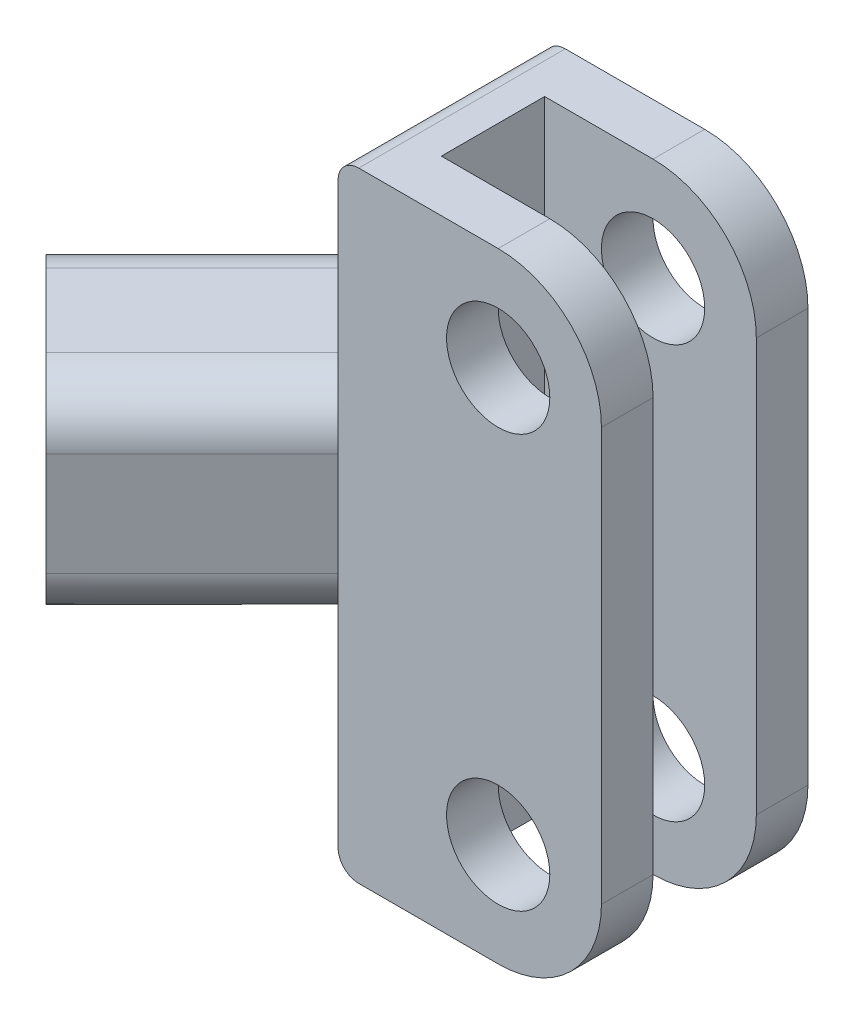
ISO-10303-21;
HEADER;
FILE_DESCRIPTION(('STEP AP214'),'2;1');
FILE_NAME('part.step','',(''),(''),'','','');
FILE_SCHEMA(('AUTOMOTIVE_DESIGN { 1 0 10303 214 1 1 1 1 }'));
ENDSEC;
DATA;
#1=APPLICATION_CONTEXT('core data for automotive mechanical design processes');
#2=APPLICATION_PROTOCOL_DEFINITION('international standard','automotive_design',2000,#1);
#3=PRODUCT_CONTEXT('',#1,'mechanical');
#4=PRODUCT('Part','Part','',(#3));
#5=PRODUCT_RELATED_PRODUCT_CATEGORY('part','',(#4));
#6=PRODUCT_DEFINITION_FORMATION('','',#4);
#7=PRODUCT_DEFINITION_CONTEXT('part definition',#1,'design');
#8=PRODUCT_DEFINITION('design','',#6,#7);
#9=PRODUCT_DEFINITION_SHAPE('','',#8);
#10=(LENGTH_UNIT() NAMED_UNIT(*) SI_UNIT(.MILLI.,.METRE.));
#11=(NAMED_UNIT(*) PLANE_ANGLE_UNIT() SI_UNIT($,.RADIAN.));
#12=(NAMED_UNIT(*) SI_UNIT($,.STERADIAN.) SOLID_ANGLE_UNIT());
#13=UNCERTAINTY_MEASURE_WITH_UNIT(LENGTH_MEASURE(1.E-05),#10,'distance_accuracy_value','');
#14=(GEOMETRIC_REPRESENTATION_CONTEXT(3) GLOBAL_UNCERTAINTY_ASSIGNED_CONTEXT((#13)) GLOBAL_UNIT_ASSIGNED_CONTEXT((#10,
#11,#12)) REPRESENTATION_CONTEXT('',''));
#15=CARTESIAN_POINT('',(0.,0.,0.));
#16=DIRECTION('',(0.,0.,1.));
#17=DIRECTION('',(1.,0.,0.));
#18=AXIS2_PLACEMENT_3D('',#15,#16,#17);
#19=CARTESIAN_POINT('',(-15.5,0.,5.));
#20=DIRECTION('',(1.,0.,0.));
#21=DIRECTION('',(0.,1.,0.));
#22=AXIS2_PLACEMENT_3D('',#19,#20,#21);
#23=PLANE('',#22);
#24=DIRECTION('',(0.,1.,0.));
#25=VECTOR('',#24,1.);
#26=CARTESIAN_POINT('',(-15.5,0.,10.));
#27=LINE('',#26,#25);
#28=CARTESIAN_POINT('',(-15.5,5.,10.));
#29=VERTEX_POINT('',#28);
#30=CARTESIAN_POINT('',(-15.5,28.,10.));
#31=VERTEX_POINT('',#30);
#32=EDGE_CURVE('E349',#29,#31,#27,.T.);
#33=ORIENTED_EDGE('',*,*,#32,.T.);
#34=DIRECTION('',(0.,0.,-1.));
#35=VECTOR('',#34,1.);
#36=CARTESIAN_POINT('',(-15.5,28.,5.));
#37=LINE('',#36,#35);
#38=CARTESIAN_POINT('',(-15.5,28.,-10.));
#39=VERTEX_POINT('',#38);
#40=EDGE_CURVE('E130',#31,#39,#37,.T.);
#41=ORIENTED_EDGE('',*,*,#40,.T.);
#42=DIRECTION('',(0.,-1.,0.));
#43=VECTOR('',#42,1.);
#44=CARTESIAN_POINT('',(-15.5,0.,-10.));
#45=LINE('',#44,#43);
#46=CARTESIAN_POINT('',(-15.5,5.,-10.));
#47=VERTEX_POINT('',#46);
#48=EDGE_CURVE('E289',#39,#47,#45,.T.);
#49=ORIENTED_EDGE('',*,*,#48,.T.);
#50=CARTESIAN_POINT('',(-15.5,5.,-5.));
#51=DIRECTION('',(1.,0.,0.));
#52=DIRECTION('',(0.,1.,0.));
#53=AXIS2_PLACEMENT_3D('',#50,#51,#52);
#54=CIRCLE('',#53,5.);
#55=CARTESIAN_POINT('',(-15.5,10.,-5.));
#56=VERTEX_POINT('',#55);
#57=EDGE_CURVE('E429',#47,#56,#54,.T.);
#58=ORIENTED_EDGE('',*,*,#57,.T.);
#59=DIRECTION('',(0.,0.,-1.));
#60=VECTOR('',#59,1.);
#61=CARTESIAN_POINT('',(-15.5,10.,10.));
#62=LINE('',#61,#60);
#63=CARTESIAN_POINT('',(-15.5,10.,2.92893218813449));
#64=VERTEX_POINT('',#63);
#65=EDGE_CURVE('E492',#64,#56,#62,.T.);
#66=ORIENTED_EDGE('',*,*,#65,.F.);
#67=CARTESIAN_POINT('',(-15.5,5.,2.92893218813448));
#68=DIRECTION('',(1.,0.,0.));
#69=DIRECTION('',(0.,0.,1.));
#70=AXIS2_PLACEMENT_3D('',#67,#68,#69);
#71=ELLIPSE('',#70,7.07106781186552,5.);
#72=EDGE_CURVE('E433',#64,#29,#71,.T.);
#73=ORIENTED_EDGE('',*,*,#72,.T.);
#74=EDGE_LOOP('',(#33,#41,#49,#58,#66,#73));
#75=FACE_BOUND('',#74,.T.);
#76=ADVANCED_FACE('F122',(#75),#23,.F.);
#77=CARTESIAN_POINT('',(-15.5,-5.,-10.));
#78=VERTEX_POINT('',#77);
#79=CARTESIAN_POINT('',(-15.5,-28.,-10.));
#80=VERTEX_POINT('',#79);
#81=EDGE_CURVE('E460',#78,#80,#45,.T.);
#82=ORIENTED_EDGE('',*,*,#81,.T.);
#83=DIRECTION('',(0.,0.,-1.));
#84=VECTOR('',#83,1.);
#85=CARTESIAN_POINT('',(-15.5,-28.,5.));
#86=LINE('',#85,#84);
#87=CARTESIAN_POINT('',(-15.5,-28.,10.));
#88=VERTEX_POINT('',#87);
#89=EDGE_CURVE('E448',#80,#88,#86,.F.);
#90=ORIENTED_EDGE('',*,*,#89,.T.);
#91=CARTESIAN_POINT('',(-15.5,-5.,10.));
#92=VERTEX_POINT('',#91);
#93=EDGE_CURVE('E350',#88,#92,#27,.T.);
#94=ORIENTED_EDGE('',*,*,#93,.T.);
#95=CARTESIAN_POINT('',(-15.5,-5.,2.92893218813447));
#96=DIRECTION('',(1.,0.,0.));
#97=DIRECTION('',(0.,0.,-1.));
#98=AXIS2_PLACEMENT_3D('',#95,#96,#97);
#99=ELLIPSE('',#98,7.07106781186552,5.);
#100=CARTESIAN_POINT('',(-15.5,-10.,2.92893218813448));
#101=VERTEX_POINT('',#100);
#102=EDGE_CURVE('E431',#92,#101,#99,.T.);
#103=ORIENTED_EDGE('',*,*,#102,.T.);
#104=DIRECTION('',(0.,0.,-1.));
#105=VECTOR('',#104,1.);
#106=CARTESIAN_POINT('',(-15.5,-10.,10.));
#107=LINE('',#106,#105);
#108=CARTESIAN_POINT('',(-15.5,-10.,-5.));
#109=VERTEX_POINT('',#108);
#110=EDGE_CURVE('E439',#101,#109,#107,.T.);
#111=ORIENTED_EDGE('',*,*,#110,.T.);
#112=CARTESIAN_POINT('',(-15.5,-5.,-5.));
#113=DIRECTION('',(1.,0.,0.));
#114=DIRECTION('',(0.,1.,0.));
#115=AXIS2_PLACEMENT_3D('',#112,#113,#114);
#116=CIRCLE('',#115,5.);
#117=EDGE_CURVE('E426',#109,#78,#116,.T.);
#118=ORIENTED_EDGE('',*,*,#117,.T.);
#119=EDGE_LOOP('',(#82,#90,#94,#103,#111,#118));
#120=FACE_BOUND('',#119,.T.);
#121=ADVANCED_FACE('F590',(#120),#23,.F.);
#122=CARTESIAN_POINT('',(0.,-30.,5.));
#123=DIRECTION('',(0.,1.,0.));
#124=DIRECTION('',(0.,0.,1.));
#125=AXIS2_PLACEMENT_3D('',#122,#123,#124);
#126=PLANE('',#125);
#127=DIRECTION('',(-1.,0.,0.));
#128=VECTOR('',#127,1.);
#129=CARTESIAN_POINT('',(0.,-30.,10.));
#130=LINE('',#129,#128);
#131=CARTESIAN_POINT('',(0.,-30.,10.));
#132=VERTEX_POINT('',#131);
#133=CARTESIAN_POINT('',(-13.5,-30.,10.));
#134=VERTEX_POINT('',#133);
#135=EDGE_CURVE('E352',#132,#134,#130,.T.);
#136=ORIENTED_EDGE('',*,*,#135,.T.);
#137=DIRECTION('',(0.,0.,-1.));
#138=VECTOR('',#137,1.);
#139=CARTESIAN_POINT('',(-13.5,-30.,5.));
#140=LINE('',#139,#138);
#141=CARTESIAN_POINT('',(-13.5,-30.,-10.));
#142=VERTEX_POINT('',#141);
#143=EDGE_CURVE('E436',#134,#142,#140,.T.);
#144=ORIENTED_EDGE('',*,*,#143,.T.);
#145=DIRECTION('',(-1.,0.,0.));
#146=VECTOR('',#145,1.);
#147=CARTESIAN_POINT('',(0.,-30.,-10.));
#148=LINE('',#147,#146);
#149=CARTESIAN_POINT('',(0.,-30.,-10.));
#150=VERTEX_POINT('',#149);
#151=EDGE_CURVE('E326',#150,#142,#148,.T.);
#152=ORIENTED_EDGE('',*,*,#151,.F.);
#153=DIRECTION('',(0.,0.,1.));
#154=VECTOR('',#153,1.);
#155=CARTESIAN_POINT('',(0.,-30.,-10.));
#156=LINE('',#155,#154);
#157=CARTESIAN_POINT('',(0.,-30.,-5.));
#158=VERTEX_POINT('',#157);
#159=EDGE_CURVE('E312',#150,#158,#156,.T.);
#160=ORIENTED_EDGE('',*,*,#159,.T.);
#161=DIRECTION('',(-1.,0.,0.));
#162=VECTOR('',#161,1.);
#163=CARTESIAN_POINT('',(0.,-30.,-5.));
#164=LINE('',#163,#162);
#165=CARTESIAN_POINT('',(-10.5,-30.,-5.));
#166=VERTEX_POINT('',#165);
#167=EDGE_CURVE('E313',#158,#166,#164,.T.);
#168=ORIENTED_EDGE('',*,*,#167,.T.);
#169=DIRECTION('',(0.,0.,-1.));
#170=VECTOR('',#169,1.);
#171=CARTESIAN_POINT('',(-10.5,-30.,5.));
#172=LINE('',#171,#170);
#173=CARTESIAN_POINT('',(-10.5,-30.,5.));
#174=VERTEX_POINT('',#173);
#175=EDGE_CURVE('E387',#174,#166,#172,.T.);
#176=ORIENTED_EDGE('',*,*,#175,.F.);
#177=DIRECTION('',(-1.,0.,0.));
#178=VECTOR('',#177,1.);
#179=CARTESIAN_POINT('',(0.,-30.,5.));
#180=LINE('',#179,#178);
#181=CARTESIAN_POINT('',(0.,-30.,5.));
#182=VERTEX_POINT('',#181);
#183=EDGE_CURVE('E364',#182,#174,#180,.T.);
#184=ORIENTED_EDGE('',*,*,#183,.F.);
#185=DIRECTION('',(0.,0.,-1.));
#186=VECTOR('',#185,1.);
#187=CARTESIAN_POINT('',(0.,-30.,10.));
#188=LINE('',#187,#186);
#189=EDGE_CURVE('E374',#132,#182,#188,.T.);
#190=ORIENTED_EDGE('',*,*,#189,.F.);
#191=EDGE_LOOP('',(#136,#144,#152,#160,#168,#176,#184,#190));
#192=FACE_BOUND('',#191,.T.);
#193=ADVANCED_FACE('F545',(#192),#126,.F.);
#194=CARTESIAN_POINT('',(-10.5,0.,5.));
#195=DIRECTION('',(1.,0.,0.));
#196=DIRECTION('',(0.,1.,0.));
#197=AXIS2_PLACEMENT_3D('',#194,#195,#196);
#198=PLANE('',#197);
#199=DIRECTION('',(0.,-1.,0.));
#200=VECTOR('',#199,1.);
#201=CARTESIAN_POINT('',(-10.5,0.,-5.));
#202=LINE('',#201,#200);
#203=CARTESIAN_POINT('',(-10.5,30.,-5.));
#204=VERTEX_POINT('',#203);
#205=EDGE_CURVE('E379',#204,#166,#202,.T.);
#206=ORIENTED_EDGE('',*,*,#205,.F.);
#207=DIRECTION('',(0.,0.,-1.));
#208=VECTOR('',#207,1.);
#209=CARTESIAN_POINT('',(-10.5,30.,5.));
#210=LINE('',#209,#208);
#211=CARTESIAN_POINT('',(-10.5,30.,5.));
#212=VERTEX_POINT('',#211);
#213=EDGE_CURVE('E383',#212,#204,#210,.T.);
#214=ORIENTED_EDGE('',*,*,#213,.F.);
#215=DIRECTION('',(0.,-1.,0.));
#216=VECTOR('',#215,1.);
#217=CARTESIAN_POINT('',(-10.5,0.,5.));
#218=LINE('',#217,#216);
#219=EDGE_CURVE('E380',#212,#174,#218,.T.);
#220=ORIENTED_EDGE('',*,*,#219,.T.);
#221=ORIENTED_EDGE('',*,*,#175,.T.);
#222=EDGE_LOOP('',(#206,#214,#220,#221));
#223=FACE_BOUND('',#222,.T.);
#224=ADVANCED_FACE('F559',(#223),#198,.T.);
#225=CARTESIAN_POINT('',(0.,30.,5.));
#226=DIRECTION('',(0.,-1.,0.));
#227=DIRECTION('',(0.,0.,-1.));
#228=AXIS2_PLACEMENT_3D('',#225,#226,#227);
#229=PLANE('',#228);
#230=DIRECTION('',(1.,0.,0.));
#231=VECTOR('',#230,1.);
#232=CARTESIAN_POINT('',(0.,30.,-10.));
#233=LINE('',#232,#231);
#234=CARTESIAN_POINT('',(-13.5,30.,-10.));
#235=VERTEX_POINT('',#234);
#236=CARTESIAN_POINT('',(0.,30.,-10.));
#237=VERTEX_POINT('',#236);
#238=EDGE_CURVE('E281',#235,#237,#233,.T.);
#239=ORIENTED_EDGE('',*,*,#238,.F.);
#240=DIRECTION('',(0.,0.,-1.));
#241=VECTOR('',#240,1.);
#242=CARTESIAN_POINT('',(-13.5,30.,5.));
#243=LINE('',#242,#241);
#244=CARTESIAN_POINT('',(-13.5,30.,10.));
#245=VERTEX_POINT('',#244);
#246=EDGE_CURVE('E12',#235,#245,#243,.F.);
#247=ORIENTED_EDGE('',*,*,#246,.T.);
#248=DIRECTION('',(1.,0.,0.));
#249=VECTOR('',#248,1.);
#250=CARTESIAN_POINT('',(0.,30.,10.));
#251=LINE('',#250,#249);
#252=CARTESIAN_POINT('',(0.,30.,10.));
#253=VERTEX_POINT('',#252);
#254=EDGE_CURVE('E346',#245,#253,#251,.T.);
#255=ORIENTED_EDGE('',*,*,#254,.T.);
#256=DIRECTION('',(0.,0.,-1.));
#257=VECTOR('',#256,1.);
#258=CARTESIAN_POINT('',(0.,30.,10.));
#259=LINE('',#258,#257);
#260=CARTESIAN_POINT('',(0.,30.,5.));
#261=VERTEX_POINT('',#260);
#262=EDGE_CURVE('E376',#253,#261,#259,.T.);
#263=ORIENTED_EDGE('',*,*,#262,.T.);
#264=DIRECTION('',(1.,0.,0.));
#265=VECTOR('',#264,1.);
#266=CARTESIAN_POINT('',(0.,30.,5.));
#267=LINE('',#266,#265);
#268=EDGE_CURVE('E362',#212,#261,#267,.T.);
#269=ORIENTED_EDGE('',*,*,#268,.F.);
#270=ORIENTED_EDGE('',*,*,#213,.T.);
#271=DIRECTION('',(1.,0.,0.));
#272=VECTOR('',#271,1.);
#273=CARTESIAN_POINT('',(0.,30.,-5.));
#274=LINE('',#273,#272);
#275=CARTESIAN_POINT('',(0.,30.,-5.));
#276=VERTEX_POINT('',#275);
#277=EDGE_CURVE('E295',#204,#276,#274,.T.);
#278=ORIENTED_EDGE('',*,*,#277,.T.);
#279=DIRECTION('',(0.,0.,1.));
#280=VECTOR('',#279,1.);
#281=CARTESIAN_POINT('',(0.,30.,-10.));
#282=LINE('',#281,#280);
#283=EDGE_CURVE('E292',#237,#276,#282,.T.);
#284=ORIENTED_EDGE('',*,*,#283,.F.);
#285=EDGE_LOOP('',(#239,#247,#255,#263,#269,#270,#278,#284));
#286=FACE_BOUND('',#285,.T.);
#287=ADVANCED_FACE('F293',(#286),#229,.F.);
#288=CARTESIAN_POINT('',(0.,20.,10.));
#289=DIRECTION('',(0.,0.,1.));
#290=DIRECTION('',(1.,0.,0.));
#291=AXIS2_PLACEMENT_3D('',#288,#289,#290);
#292=PLANE('',#291);
#293=CARTESIAN_POINT('',(0.,-20.,10.));
#294=DIRECTION('',(0.,0.,1.));
#295=DIRECTION('',(1.,0.,0.));
#296=AXIS2_PLACEMENT_3D('',#293,#294,#295);
#297=CIRCLE('',#296,5.);
#298=CARTESIAN_POINT('',(5.,-20.,10.));
#299=VERTEX_POINT('',#298);
#300=EDGE_CURVE('E337',#299,#299,#297,.T.);
#301=ORIENTED_EDGE('',*,*,#300,.F.);
#302=EDGE_LOOP('',(#301));
#303=FACE_BOUND('',#302,.T.);
#304=ORIENTED_EDGE('',*,*,#93,.F.);
#305=CARTESIAN_POINT('',(-13.5,-28.,10.));
#306=DIRECTION('',(0.,0.,1.));
#307=DIRECTION('',(1.,0.,0.));
#308=AXIS2_PLACEMENT_3D('',#305,#306,#307);
#309=CIRCLE('',#308,2.);
#310=EDGE_CURVE('E451',#88,#134,#309,.T.);
#311=ORIENTED_EDGE('',*,*,#310,.T.);
#312=ORIENTED_EDGE('',*,*,#135,.F.);
#313=CARTESIAN_POINT('',(0.,-20.,10.));
#314=DIRECTION('',(0.,0.,1.));
#315=DIRECTION('',(1.,0.,0.));
#316=AXIS2_PLACEMENT_3D('',#313,#314,#315);
#317=CIRCLE('',#316,9.99999999999999);
#318=CARTESIAN_POINT('',(10.,-20.,10.));
#319=VERTEX_POINT('',#318);
#320=EDGE_CURVE('E355',#132,#319,#317,.T.);
#321=ORIENTED_EDGE('',*,*,#320,.T.);
#322=DIRECTION('',(0.,1.,0.));
#323=VECTOR('',#322,1.);
#324=CARTESIAN_POINT('',(9.99999999999999,0.,10.));
#325=LINE('',#324,#323);
#326=CARTESIAN_POINT('',(9.99999999999998,20.,10.));
#327=VERTEX_POINT('',#326);
#328=EDGE_CURVE('E357',#319,#327,#325,.T.);
#329=ORIENTED_EDGE('',*,*,#328,.T.);
#330=CARTESIAN_POINT('',(0.,20.,10.));
#331=DIRECTION('',(0.,0.,1.));
#332=DIRECTION('',(1.,0.,0.));
#333=AXIS2_PLACEMENT_3D('',#330,#331,#332);
#334=CIRCLE('',#333,9.99999999999999);
#335=EDGE_CURVE('E343',#327,#253,#334,.T.);
#336=ORIENTED_EDGE('',*,*,#335,.T.);
#337=ORIENTED_EDGE('',*,*,#254,.F.);
#338=CARTESIAN_POINT('',(-13.5,28.,10.));
#339=DIRECTION('',(0.,0.,1.));
#340=DIRECTION('',(1.,0.,0.));
#341=AXIS2_PLACEMENT_3D('',#338,#339,#340);
#342=CIRCLE('',#341,2.);
#343=EDGE_CURVE('E137',#245,#31,#342,.T.);
#344=ORIENTED_EDGE('',*,*,#343,.T.);
#345=ORIENTED_EDGE('',*,*,#32,.F.);
#346=DIRECTION('',(0.,-1.,0.));
#347=VECTOR('',#346,1.);
#348=CARTESIAN_POINT('',(-15.5,10.,10.));
#349=LINE('',#348,#347);
#350=EDGE_CURVE('E473',#29,#92,#349,.T.);
#351=ORIENTED_EDGE('',*,*,#350,.T.);
#352=EDGE_LOOP('',(#304,#311,#312,#321,#329,#336,#337,#344,#345,#351));
#353=FACE_BOUND('',#352,.T.);
#354=CARTESIAN_POINT('',(0.,20.,10.));
#355=DIRECTION('',(0.,0.,1.));
#356=DIRECTION('',(1.,0.,0.));
#357=AXIS2_PLACEMENT_3D('',#354,#355,#356);
#358=CIRCLE('',#357,5.);
#359=CARTESIAN_POINT('',(4.99999999999999,20.,10.));
#360=VERTEX_POINT('',#359);
#361=EDGE_CURVE('E331',#360,#360,#358,.T.);
#362=ORIENTED_EDGE('',*,*,#361,.F.);
#363=EDGE_LOOP('',(#362));
#364=FACE_BOUND('',#363,.T.);
#365=ADVANCED_FACE('F534',(#303,#353,#364),#292,.T.);
#366=CARTESIAN_POINT('',(0.,20.,5.));
#367=DIRECTION('',(0.,0.,1.));
#368=DIRECTION('',(1.,0.,0.));
#369=AXIS2_PLACEMENT_3D('',#366,#367,#368);
#370=PLANE('',#369);
#371=ORIENTED_EDGE('',*,*,#219,.F.);
#372=ORIENTED_EDGE('',*,*,#268,.T.);
#373=CARTESIAN_POINT('',(0.,20.,5.));
#374=DIRECTION('',(0.,0.,1.));
#375=DIRECTION('',(1.,0.,0.));
#376=AXIS2_PLACEMENT_3D('',#373,#374,#375);
#377=CIRCLE('',#376,9.99999999999999);
#378=CARTESIAN_POINT('',(9.99999999999998,20.,5.));
#379=VERTEX_POINT('',#378);
#380=EDGE_CURVE('E340',#379,#261,#377,.T.);
#381=ORIENTED_EDGE('',*,*,#380,.F.);
#382=DIRECTION('',(0.,1.,0.));
#383=VECTOR('',#382,1.);
#384=CARTESIAN_POINT('',(9.99999999999999,0.,5.));
#385=LINE('',#384,#383);
#386=CARTESIAN_POINT('',(10.,-20.,5.));
#387=VERTEX_POINT('',#386);
#388=EDGE_CURVE('E347',#387,#379,#385,.T.);
#389=ORIENTED_EDGE('',*,*,#388,.F.);
#390=CARTESIAN_POINT('',(0.,-20.,5.));
#391=DIRECTION('',(0.,0.,1.));
#392=DIRECTION('',(1.,0.,0.));
#393=AXIS2_PLACEMENT_3D('',#390,#391,#392);
#394=CIRCLE('',#393,9.99999999999999);
#395=EDGE_CURVE('E366',#182,#387,#394,.T.);
#396=ORIENTED_EDGE('',*,*,#395,.F.);
#397=ORIENTED_EDGE('',*,*,#183,.T.);
#398=EDGE_LOOP('',(#371,#372,#381,#389,#396,#397));
#399=FACE_BOUND('',#398,.T.);
#400=CARTESIAN_POINT('',(0.,-20.,5.));
#401=DIRECTION('',(0.,0.,1.));
#402=DIRECTION('',(1.,0.,0.));
#403=AXIS2_PLACEMENT_3D('',#400,#401,#402);
#404=CIRCLE('',#403,5.);
#405=CARTESIAN_POINT('',(5.,-20.,5.));
#406=VERTEX_POINT('',#405);
#407=EDGE_CURVE('E334',#406,#406,#404,.T.);
#408=ORIENTED_EDGE('',*,*,#407,.T.);
#409=EDGE_LOOP('',(#408));
#410=FACE_BOUND('',#409,.T.);
#411=CARTESIAN_POINT('',(0.,20.,5.));
#412=DIRECTION('',(0.,0.,1.));
#413=DIRECTION('',(1.,0.,0.));
#414=AXIS2_PLACEMENT_3D('',#411,#412,#413);
#415=CIRCLE('',#414,5.);
#416=CARTESIAN_POINT('',(4.99999999999999,20.,5.));
#417=VERTEX_POINT('',#416);
#418=EDGE_CURVE('E299',#417,#417,#415,.T.);
#419=ORIENTED_EDGE('',*,*,#418,.T.);
#420=EDGE_LOOP('',(#419));
#421=FACE_BOUND('',#420,.T.);
#422=ADVANCED_FACE('F564',(#399,#410,#421),#370,.F.);
#423=CARTESIAN_POINT('',(0.,20.,10.));
#424=DIRECTION('',(0.,0.,-1.));
#425=DIRECTION('',(-1.,0.,0.));
#426=AXIS2_PLACEMENT_3D('',#423,#424,#425);
#427=CYLINDRICAL_SURFACE('',#426,9.99999999999999);
#428=ORIENTED_EDGE('',*,*,#380,.T.);
#429=ORIENTED_EDGE('',*,*,#262,.F.);
#430=ORIENTED_EDGE('',*,*,#335,.F.);
#431=DIRECTION('',(0.,0.,-1.));
#432=VECTOR('',#431,1.);
#433=CARTESIAN_POINT('',(9.99999999999998,20.,10.));
#434=LINE('',#433,#432);
#435=EDGE_CURVE('E359',#327,#379,#434,.T.);
#436=ORIENTED_EDGE('',*,*,#435,.T.);
#437=EDGE_LOOP('',(#428,#429,#430,#436));
#438=FACE_BOUND('',#437,.T.);
#439=ADVANCED_FACE('F579',(#438),#427,.T.);
#440=CARTESIAN_POINT('',(0.,-20.,10.));
#441=DIRECTION('',(0.,0.,-1.));
#442=DIRECTION('',(-1.,0.,0.));
#443=AXIS2_PLACEMENT_3D('',#440,#441,#442);
#444=CYLINDRICAL_SURFACE('',#443,9.99999999999999);
#445=ORIENTED_EDGE('',*,*,#395,.T.);
#446=DIRECTION('',(0.,0.,-1.));
#447=VECTOR('',#446,1.);
#448=CARTESIAN_POINT('',(10.,-20.,10.));
#449=LINE('',#448,#447);
#450=EDGE_CURVE('E371',#319,#387,#449,.T.);
#451=ORIENTED_EDGE('',*,*,#450,.F.);
#452=ORIENTED_EDGE('',*,*,#320,.F.);
#453=ORIENTED_EDGE('',*,*,#189,.T.);
#454=EDGE_LOOP('',(#445,#451,#452,#453));
#455=FACE_BOUND('',#454,.T.);
#456=ADVANCED_FACE('F571',(#455),#444,.T.);
#457=CARTESIAN_POINT('',(9.99999999999999,0.,10.));
#458=DIRECTION('',(-1.,0.,0.));
#459=DIRECTION('',(0.,-1.,0.));
#460=AXIS2_PLACEMENT_3D('',#457,#458,#459);
#461=PLANE('',#460);
#462=ORIENTED_EDGE('',*,*,#388,.T.);
#463=ORIENTED_EDGE('',*,*,#435,.F.);
#464=ORIENTED_EDGE('',*,*,#328,.F.);
#465=ORIENTED_EDGE('',*,*,#450,.T.);
#466=EDGE_LOOP('',(#462,#463,#464,#465));
#467=FACE_BOUND('',#466,.T.);
#468=ADVANCED_FACE('F574',(#467),#461,.F.);
#469=CARTESIAN_POINT('',(0.,-20.,10.));
#470=DIRECTION('',(0.,0.,-1.));
#471=DIRECTION('',(-1.,0.,0.));
#472=AXIS2_PLACEMENT_3D('',#469,#470,#471);
#473=CYLINDRICAL_SURFACE('',#472,5.);
#474=ORIENTED_EDGE('',*,*,#300,.T.);
#475=EDGE_LOOP('',(#474));
#476=FACE_BOUND('',#475,.T.);
#477=ORIENTED_EDGE('',*,*,#407,.F.);
#478=EDGE_LOOP('',(#477));
#479=FACE_BOUND('',#478,.T.);
#480=ADVANCED_FACE('F842',(#476,#479),#473,.F.);
#481=CARTESIAN_POINT('',(0.,20.,10.));
#482=DIRECTION('',(0.,0.,-1.));
#483=DIRECTION('',(-1.,0.,0.));
#484=AXIS2_PLACEMENT_3D('',#481,#482,#483);
#485=CYLINDRICAL_SURFACE('',#484,5.);
#486=ORIENTED_EDGE('',*,*,#361,.T.);
#487=EDGE_LOOP('',(#486));
#488=FACE_BOUND('',#487,.T.);
#489=ORIENTED_EDGE('',*,*,#418,.F.);
#490=EDGE_LOOP('',(#489));
#491=FACE_BOUND('',#490,.T.);
#492=ADVANCED_FACE('F839',(#488,#491),#485,.F.);
#493=CARTESIAN_POINT('',(0.,20.,-10.));
#494=DIRECTION('',(0.,0.,1.));
#495=DIRECTION('',(1.,0.,0.));
#496=AXIS2_PLACEMENT_3D('',#493,#494,#495);
#497=CYLINDRICAL_SURFACE('',#496,9.99999999999999);
#498=CARTESIAN_POINT('',(0.,20.,-5.));
#499=DIRECTION('',(0.,0.,1.));
#500=DIRECTION('',(1.,0.,0.));
#501=AXIS2_PLACEMENT_3D('',#498,#499,#500);
#502=CIRCLE('',#501,9.99999999999999);
#503=CARTESIAN_POINT('',(9.99999999999998,20.,-5.));
#504=VERTEX_POINT('',#503);
#505=EDGE_CURVE('E318',#504,#276,#502,.T.);
#506=ORIENTED_EDGE('',*,*,#505,.F.);
#507=DIRECTION('',(0.,0.,1.));
#508=VECTOR('',#507,1.);
#509=CARTESIAN_POINT('',(9.99999999999998,20.,-10.));
#510=LINE('',#509,#508);
#511=CARTESIAN_POINT('',(9.99999999999998,20.,-10.));
#512=VERTEX_POINT('',#511);
#513=EDGE_CURVE('E300',#512,#504,#510,.T.);
#514=ORIENTED_EDGE('',*,*,#513,.F.);
#515=CARTESIAN_POINT('',(0.,20.,-10.));
#516=DIRECTION('',(0.,0.,1.));
#517=DIRECTION('',(1.,0.,0.));
#518=AXIS2_PLACEMENT_3D('',#515,#516,#517);
#519=CIRCLE('',#518,9.99999999999999);
#520=EDGE_CURVE('E286',#512,#237,#519,.T.);
#521=ORIENTED_EDGE('',*,*,#520,.T.);
#522=ORIENTED_EDGE('',*,*,#283,.T.);
#523=EDGE_LOOP('',(#506,#514,#521,#522));
#524=FACE_BOUND('',#523,.T.);
#525=ADVANCED_FACE('F302',(#524),#497,.T.);
#526=CARTESIAN_POINT('',(9.99999999999999,0.,-10.));
#527=DIRECTION('',(-1.,0.,0.));
#528=DIRECTION('',(0.,-1.,0.));
#529=AXIS2_PLACEMENT_3D('',#526,#527,#528);
#530=PLANE('',#529);
#531=DIRECTION('',(0.,-1.,0.));
#532=VECTOR('',#531,1.);
#533=CARTESIAN_POINT('',(9.99999999999999,0.,-5.));
#534=LINE('',#533,#532);
#535=CARTESIAN_POINT('',(10.,-20.,-5.));
#536=VERTEX_POINT('',#535);
#537=EDGE_CURVE('E320',#504,#536,#534,.T.);
#538=ORIENTED_EDGE('',*,*,#537,.T.);
#539=DIRECTION('',(0.,0.,1.));
#540=VECTOR('',#539,1.);
#541=CARTESIAN_POINT('',(10.,-20.,-10.));
#542=LINE('',#541,#540);
#543=CARTESIAN_POINT('',(10.,-20.,-10.));
#544=VERTEX_POINT('',#543);
#545=EDGE_CURVE('E328',#544,#536,#542,.T.);
#546=ORIENTED_EDGE('',*,*,#545,.F.);
#547=DIRECTION('',(0.,-1.,0.));
#548=VECTOR('',#547,1.);
#549=CARTESIAN_POINT('',(9.99999999999999,0.,-10.));
#550=LINE('',#549,#548);
#551=EDGE_CURVE('E304',#512,#544,#550,.T.);
#552=ORIENTED_EDGE('',*,*,#551,.F.);
#553=ORIENTED_EDGE('',*,*,#513,.T.);
#554=EDGE_LOOP('',(#538,#546,#552,#553));
#555=FACE_BOUND('',#554,.T.);
#556=ADVANCED_FACE('F834',(#555),#530,.F.);
#557=CARTESIAN_POINT('',(0.,-20.,-10.));
#558=DIRECTION('',(0.,0.,1.));
#559=DIRECTION('',(1.,0.,0.));
#560=AXIS2_PLACEMENT_3D('',#557,#558,#559);
#561=CYLINDRICAL_SURFACE('',#560,9.99999999999999);
#562=CARTESIAN_POINT('',(0.,-20.,-5.));
#563=DIRECTION('',(0.,0.,1.));
#564=DIRECTION('',(1.,0.,0.));
#565=AXIS2_PLACEMENT_3D('',#562,#563,#564);
#566=CIRCLE('',#565,9.99999999999999);
#567=EDGE_CURVE('E323',#158,#536,#566,.T.);
#568=ORIENTED_EDGE('',*,*,#567,.F.);
#569=ORIENTED_EDGE('',*,*,#159,.F.);
#570=CARTESIAN_POINT('',(0.,-20.,-10.));
#571=DIRECTION('',(0.,0.,1.));
#572=DIRECTION('',(1.,0.,0.));
#573=AXIS2_PLACEMENT_3D('',#570,#571,#572);
#574=CIRCLE('',#573,9.99999999999999);
#575=EDGE_CURVE('E306',#150,#544,#574,.T.);
#576=ORIENTED_EDGE('',*,*,#575,.T.);
#577=ORIENTED_EDGE('',*,*,#545,.T.);
#578=EDGE_LOOP('',(#568,#569,#576,#577));
#579=FACE_BOUND('',#578,.T.);
#580=ADVANCED_FACE('F550',(#579),#561,.T.);
#581=CARTESIAN_POINT('',(0.,20.,-10.));
#582=DIRECTION('',(0.,0.,1.));
#583=DIRECTION('',(1.,0.,0.));
#584=AXIS2_PLACEMENT_3D('',#581,#582,#583);
#585=PLANE('',#584);
#586=CARTESIAN_POINT('',(0.,20.,-10.));
#587=DIRECTION('',(0.,0.,1.));
#588=DIRECTION('',(1.,0.,0.));
#589=AXIS2_PLACEMENT_3D('',#586,#587,#588);
#590=CIRCLE('',#589,5.);
#591=CARTESIAN_POINT('',(4.99999999999999,20.,-10.));
#592=VERTEX_POINT('',#591);
#593=EDGE_CURVE('E467',#592,#592,#590,.T.);
#594=ORIENTED_EDGE('',*,*,#593,.T.);
#595=EDGE_LOOP('',(#594));
#596=FACE_BOUND('',#595,.T.);
#597=CARTESIAN_POINT('',(0.,-20.,-10.));
#598=DIRECTION('',(0.,0.,1.));
#599=DIRECTION('',(1.,0.,0.));
#600=AXIS2_PLACEMENT_3D('',#597,#598,#599);
#601=CIRCLE('',#600,5.);
#602=CARTESIAN_POINT('',(5.,-20.,-10.));
#603=VERTEX_POINT('',#602);
#604=EDGE_CURVE('E316',#603,#603,#601,.T.);
#605=ORIENTED_EDGE('',*,*,#604,.T.);
#606=EDGE_LOOP('',(#605));
#607=FACE_BOUND('',#606,.T.);
#608=ORIENTED_EDGE('',*,*,#151,.T.);
#609=CARTESIAN_POINT('',(-13.5,-28.,-10.));
#610=DIRECTION('',(0.,0.,1.));
#611=DIRECTION('',(1.,0.,0.));
#612=AXIS2_PLACEMENT_3D('',#609,#610,#611);
#613=CIRCLE('',#612,2.);
#614=EDGE_CURVE('E446',#142,#80,#613,.F.);
#615=ORIENTED_EDGE('',*,*,#614,.T.);
#616=ORIENTED_EDGE('',*,*,#81,.F.);
#617=DIRECTION('',(0.,-1.,0.));
#618=VECTOR('',#617,1.);
#619=CARTESIAN_POINT('',(-15.5,10.,-10.));
#620=LINE('',#619,#618);
#621=EDGE_CURVE('E458',#47,#78,#620,.T.);
#622=ORIENTED_EDGE('',*,*,#621,.F.);
#623=ORIENTED_EDGE('',*,*,#48,.F.);
#624=CARTESIAN_POINT('',(-13.5,28.,-10.));
#625=DIRECTION('',(0.,0.,1.));
#626=DIRECTION('',(1.,0.,0.));
#627=AXIS2_PLACEMENT_3D('',#624,#625,#626);
#628=CIRCLE('',#627,2.);
#629=EDGE_CURVE('E288',#39,#235,#628,.F.);
#630=ORIENTED_EDGE('',*,*,#629,.T.);
#631=ORIENTED_EDGE('',*,*,#238,.T.);
#632=ORIENTED_EDGE('',*,*,#520,.F.);
#633=ORIENTED_EDGE('',*,*,#551,.T.);
#634=ORIENTED_EDGE('',*,*,#575,.F.);
#635=EDGE_LOOP('',(#608,#615,#616,#622,#623,#630,#631,#632,#633,#634));
#636=FACE_BOUND('',#635,.T.);
#637=ADVANCED_FACE('F284',(#596,#607,#636),#585,.F.);
#638=CARTESIAN_POINT('',(0.,20.,-5.));
#639=DIRECTION('',(0.,0.,1.));
#640=DIRECTION('',(1.,0.,0.));
#641=AXIS2_PLACEMENT_3D('',#638,#639,#640);
#642=PLANE('',#641);
#643=CARTESIAN_POINT('',(0.,20.,-5.));
#644=DIRECTION('',(0.,0.,1.));
#645=DIRECTION('',(1.,0.,0.));
#646=AXIS2_PLACEMENT_3D('',#643,#644,#645);
#647=CIRCLE('',#646,5.);
#648=CARTESIAN_POINT('',(4.99999999999999,20.,-5.));
#649=VERTEX_POINT('',#648);
#650=EDGE_CURVE('E470',#649,#649,#647,.T.);
#651=ORIENTED_EDGE('',*,*,#650,.F.);
#652=EDGE_LOOP('',(#651));
#653=FACE_BOUND('',#652,.T.);
#654=CARTESIAN_POINT('',(0.,-20.,-5.));
#655=DIRECTION('',(0.,0.,1.));
#656=DIRECTION('',(1.,0.,0.));
#657=AXIS2_PLACEMENT_3D('',#654,#655,#656);
#658=CIRCLE('',#657,5.);
#659=CARTESIAN_POINT('',(5.,-20.,-5.));
#660=VERTEX_POINT('',#659);
#661=EDGE_CURVE('E464',#660,#660,#658,.T.);
#662=ORIENTED_EDGE('',*,*,#661,.F.);
#663=EDGE_LOOP('',(#662));
#664=FACE_BOUND('',#663,.T.);
#665=ORIENTED_EDGE('',*,*,#277,.F.);
#666=ORIENTED_EDGE('',*,*,#205,.T.);
#667=ORIENTED_EDGE('',*,*,#167,.F.);
#668=ORIENTED_EDGE('',*,*,#567,.T.);
#669=ORIENTED_EDGE('',*,*,#537,.F.);
#670=ORIENTED_EDGE('',*,*,#505,.T.);
#671=EDGE_LOOP('',(#665,#666,#667,#668,#669,#670));
#672=FACE_BOUND('',#671,.T.);
#673=ADVANCED_FACE('F554',(#653,#664,#672),#642,.T.);
#674=CARTESIAN_POINT('',(0.,-20.,-10.));
#675=DIRECTION('',(0.,0.,1.));
#676=DIRECTION('',(1.,0.,0.));
#677=AXIS2_PLACEMENT_3D('',#674,#675,#676);
#678=CYLINDRICAL_SURFACE('',#677,5.);
#679=ORIENTED_EDGE('',*,*,#604,.F.);
#680=EDGE_LOOP('',(#679));
#681=FACE_BOUND('',#680,.T.);
#682=ORIENTED_EDGE('',*,*,#661,.T.);
#683=EDGE_LOOP('',(#682));
#684=FACE_BOUND('',#683,.T.);
#685=ADVANCED_FACE('F791',(#681,#684),#678,.F.);
#686=CARTESIAN_POINT('',(0.,20.,-10.));
#687=DIRECTION('',(0.,0.,1.));
#688=DIRECTION('',(1.,0.,0.));
#689=AXIS2_PLACEMENT_3D('',#686,#687,#688);
#690=CYLINDRICAL_SURFACE('',#689,5.);
#691=ORIENTED_EDGE('',*,*,#593,.F.);
#692=EDGE_LOOP('',(#691));
#693=FACE_BOUND('',#692,.T.);
#694=ORIENTED_EDGE('',*,*,#650,.T.);
#695=EDGE_LOOP('',(#694));
#696=FACE_BOUND('',#695,.T.);
#697=ADVANCED_FACE('F725',(#693,#696),#690,.F.);
#698=CARTESIAN_POINT('',(-15.5,10.,10.));
#699=DIRECTION('',(-0.707106781186552,0.,-0.707106781186544));
#700=DIRECTION('',(-0.707106781186544,0.,0.707106781186552));
#701=AXIS2_PLACEMENT_3D('',#698,#699,#700);
#702=PLANE('',#701);
#703=DIRECTION('',(0.,-1.,0.));
#704=VECTOR('',#703,1.);
#705=CARTESIAN_POINT('',(-29.6421356237309,10.,24.142135623731));
#706=LINE('',#705,#704);
#707=CARTESIAN_POINT('',(-29.6421356237309,5.,24.142135623731));
#708=VERTEX_POINT('',#707);
#709=CARTESIAN_POINT('',(-29.6421356237309,-5.,24.142135623731));
#710=VERTEX_POINT('',#709);
#711=EDGE_CURVE('E485',#708,#710,#706,.T.);
#712=ORIENTED_EDGE('',*,*,#711,.T.);
#713=DIRECTION('',(0.707106781186544,0.,-0.707106781186552));
#714=VECTOR('',#713,1.);
#715=CARTESIAN_POINT('',(-15.5,-5.,10.));
#716=LINE('',#715,#714);
#717=EDGE_CURVE('E411',#710,#92,#716,.T.);
#718=ORIENTED_EDGE('',*,*,#717,.T.);
#719=ORIENTED_EDGE('',*,*,#350,.F.);
#720=DIRECTION('',(0.707106781186544,0.,-0.707106781186552));
#721=VECTOR('',#720,1.);
#722=CARTESIAN_POINT('',(-29.6421356237309,5.,24.142135623731));
#723=LINE('',#722,#721);
#724=EDGE_CURVE('E409',#29,#708,#723,.F.);
#725=ORIENTED_EDGE('',*,*,#724,.T.);
#726=EDGE_LOOP('',(#712,#718,#719,#725));
#727=FACE_BOUND('',#726,.T.);
#728=ADVANCED_FACE('F532',(#727),#702,.F.);
#729=CARTESIAN_POINT('',(-15.5,10.,10.));
#730=DIRECTION('',(0.,-1.,0.));
#731=DIRECTION('',(0.,0.,-1.));
#732=AXIS2_PLACEMENT_3D('',#729,#730,#731);
#733=CYLINDRICAL_SURFACE('',#732,20.);
#734=ORIENTED_EDGE('',*,*,#621,.T.);
#735=CARTESIAN_POINT('',(-15.5,-5.,10.));
#736=DIRECTION('',(0.,1.,0.));
#737=DIRECTION('',(0.,0.,1.));
#738=AXIS2_PLACEMENT_3D('',#735,#736,#737);
#739=CIRCLE('',#738,20.);
#740=CARTESIAN_POINT('',(-29.642135623731,-5.,-4.14213562373087));
#741=VERTEX_POINT('',#740);
#742=EDGE_CURVE('E392',#78,#741,#739,.T.);
#743=ORIENTED_EDGE('',*,*,#742,.T.);
#744=DIRECTION('',(0.,-1.,0.));
#745=VECTOR('',#744,1.);
#746=CARTESIAN_POINT('',(-29.642135623731,10.,-4.14213562373087));
#747=LINE('',#746,#745);
#748=CARTESIAN_POINT('',(-29.642135623731,5.,-4.14213562373087));
#749=VERTEX_POINT('',#748);
#750=EDGE_CURVE('E479',#749,#741,#747,.T.);
#751=ORIENTED_EDGE('',*,*,#750,.F.);
#752=CARTESIAN_POINT('',(-15.5,5.,10.));
#753=DIRECTION('',(0.,1.,0.));
#754=DIRECTION('',(0.,0.,1.));
#755=AXIS2_PLACEMENT_3D('',#752,#753,#754);
#756=CIRCLE('',#755,20.);
#757=EDGE_CURVE('E389',#749,#47,#756,.F.);
#758=ORIENTED_EDGE('',*,*,#757,.T.);
#759=EDGE_LOOP('',(#734,#743,#751,#758));
#760=FACE_BOUND('',#759,.T.);
#761=ADVANCED_FACE('F708',(#760),#733,.T.);
#762=CARTESIAN_POINT('',(-29.642135623731,10.,-4.14213562373087));
#763=DIRECTION('',(0.707106781186552,0.,0.707106781186544));
#764=DIRECTION('',(0.707106781186544,0.,-0.707106781186552));
#765=AXIS2_PLACEMENT_3D('',#762,#763,#764);
#766=PLANE('',#765);
#767=ORIENTED_EDGE('',*,*,#750,.T.);
#768=DIRECTION('',(-0.707106781186544,0.,0.707106781186552));
#769=VECTOR('',#768,1.);
#770=CARTESIAN_POINT('',(-29.642135623731,-5.,-4.14213562373087));
#771=LINE('',#770,#769);
#772=CARTESIAN_POINT('',(-43.7842712474619,-5.,10.0000000000002));
#773=VERTEX_POINT('',#772);
#774=EDGE_CURVE('E424',#741,#773,#771,.T.);
#775=ORIENTED_EDGE('',*,*,#774,.T.);
#776=DIRECTION('',(0.,-1.,0.));
#777=VECTOR('',#776,1.);
#778=CARTESIAN_POINT('',(-43.7842712474619,10.,10.0000000000002));
#779=LINE('',#778,#777);
#780=CARTESIAN_POINT('',(-43.7842712474619,5.,10.0000000000002));
#781=VERTEX_POINT('',#780);
#782=EDGE_CURVE('E482',#781,#773,#779,.T.);
#783=ORIENTED_EDGE('',*,*,#782,.F.);
#784=DIRECTION('',(-0.707106781186544,0.,0.707106781186552));
#785=VECTOR('',#784,1.);
#786=CARTESIAN_POINT('',(-29.642135623731,5.,-4.14213562373087));
#787=LINE('',#786,#785);
#788=EDGE_CURVE('E422',#781,#749,#787,.F.);
#789=ORIENTED_EDGE('',*,*,#788,.T.);
#790=EDGE_LOOP('',(#767,#775,#783,#789));
#791=FACE_BOUND('',#790,.T.);
#792=ADVANCED_FACE('F517',(#791),#766,.F.);
#793=CARTESIAN_POINT('',(-29.6421356237309,10.,24.142135623731));
#794=DIRECTION('',(0.707106781186544,0.,-0.707106781186551));
#795=DIRECTION('',(-0.707106781186551,0.,-0.707106781186544));
#796=AXIS2_PLACEMENT_3D('',#793,#794,#795);
#797=PLANE('',#796);
#798=CARTESIAN_POINT('',(-36.7132034355964,0.,17.0710678118656));
#799=DIRECTION('',(-0.707106781186544,0.,0.707106781186551));
#800=DIRECTION('',(0.707106781186551,0.,0.707106781186544));
#801=AXIS2_PLACEMENT_3D('',#798,#799,#800);
#802=CIRCLE('',#801,7.5);
#803=CARTESIAN_POINT('',(-31.4099025766973,0.,22.3743686707647));
#804=VERTEX_POINT('',#803);
#805=EDGE_CURVE('E499',#804,#804,#802,.T.);
#806=ORIENTED_EDGE('',*,*,#805,.F.);
#807=EDGE_LOOP('',(#806));
#808=FACE_BOUND('',#807,.T.);
#809=DIRECTION('',(0.707106781186551,0.,0.707106781186544));
#810=VECTOR('',#809,1.);
#811=CARTESIAN_POINT('',(-29.6421356237309,-10.,24.142135623731));
#812=LINE('',#811,#810);
#813=CARTESIAN_POINT('',(-40.2487373415292,-10.,13.5355339059329));
#814=VERTEX_POINT('',#813);
#815=CARTESIAN_POINT('',(-33.1776695296636,-10.,20.6066017177983));
#816=VERTEX_POINT('',#815);
#817=EDGE_CURVE('E489',#814,#816,#812,.T.);
#818=ORIENTED_EDGE('',*,*,#817,.T.);
#819=CARTESIAN_POINT('',(-33.1776695296636,-5.,20.6066017177983));
#820=DIRECTION('',(0.707106781186544,0.,-0.707106781186551));
#821=DIRECTION('',(-0.707106781186551,0.,-0.707106781186544));
#822=AXIS2_PLACEMENT_3D('',#819,#820,#821);
#823=CIRCLE('',#822,5.);
#824=EDGE_CURVE('E420',#816,#710,#823,.F.);
#825=ORIENTED_EDGE('',*,*,#824,.T.);
#826=ORIENTED_EDGE('',*,*,#711,.F.);
#827=CARTESIAN_POINT('',(-33.1776695296636,5.,20.6066017177983));
#828=DIRECTION('',(0.707106781186544,0.,-0.707106781186551));
#829=DIRECTION('',(-0.707106781186551,0.,-0.707106781186544));
#830=AXIS2_PLACEMENT_3D('',#827,#828,#829);
#831=CIRCLE('',#830,5.);
#832=CARTESIAN_POINT('',(-33.1776695296636,10.,20.6066017177983));
#833=VERTEX_POINT('',#832);
#834=EDGE_CURVE('E418',#708,#833,#831,.F.);
#835=ORIENTED_EDGE('',*,*,#834,.T.);
#836=DIRECTION('',(0.707106781186551,0.,0.707106781186544));
#837=VECTOR('',#836,1.);
#838=CARTESIAN_POINT('',(-29.6421356237309,10.,24.142135623731));
#839=LINE('',#838,#837);
#840=CARTESIAN_POINT('',(-40.2487373415292,10.,13.5355339059329));
#841=VERTEX_POINT('',#840);
#842=EDGE_CURVE('E488',#841,#833,#839,.T.);
#843=ORIENTED_EDGE('',*,*,#842,.F.);
#844=CARTESIAN_POINT('',(-40.2487373415292,5.,13.5355339059329));
#845=DIRECTION('',(0.707106781186544,0.,-0.707106781186551));
#846=DIRECTION('',(-0.707106781186551,0.,-0.707106781186544));
#847=AXIS2_PLACEMENT_3D('',#844,#845,#846);
#848=CIRCLE('',#847,5.);
#849=EDGE_CURVE('E414',#841,#781,#848,.F.);
#850=ORIENTED_EDGE('',*,*,#849,.T.);
#851=ORIENTED_EDGE('',*,*,#782,.T.);
#852=CARTESIAN_POINT('',(-40.2487373415292,-5.,13.5355339059329));
#853=DIRECTION('',(0.707106781186544,0.,-0.707106781186551));
#854=DIRECTION('',(-0.707106781186551,0.,-0.707106781186544));
#855=AXIS2_PLACEMENT_3D('',#852,#853,#854);
#856=CIRCLE('',#855,5.);
#857=EDGE_CURVE('E416',#773,#814,#856,.F.);
#858=ORIENTED_EDGE('',*,*,#857,.T.);
#859=EDGE_LOOP('',(#818,#825,#826,#835,#843,#850,#851,#858));
#860=FACE_BOUND('',#859,.T.);
#861=ADVANCED_FACE('F513',(#808,#860),#797,.F.);
#862=CARTESIAN_POINT('',(-15.5,10.,10.));
#863=DIRECTION('',(0.,1.,0.));
#864=DIRECTION('',(0.,0.,1.));
#865=AXIS2_PLACEMENT_3D('',#862,#863,#864);
#866=PLANE('',#865);
#867=ORIENTED_EDGE('',*,*,#842,.T.);
#868=DIRECTION('',(0.707106781186544,0.,-0.707106781186552));
#869=VECTOR('',#868,1.);
#870=CARTESIAN_POINT('',(-19.0355339059328,10.,6.46446609406728));
#871=LINE('',#870,#869);
#872=EDGE_CURVE('E406',#833,#64,#871,.T.);
#873=ORIENTED_EDGE('',*,*,#872,.T.);
#874=ORIENTED_EDGE('',*,*,#65,.T.);
#875=CARTESIAN_POINT('',(-15.5,10.,10.));
#876=DIRECTION('',(0.,1.,0.));
#877=DIRECTION('',(0.,0.,1.));
#878=AXIS2_PLACEMENT_3D('',#875,#876,#877);
#879=CIRCLE('',#878,15.);
#880=CARTESIAN_POINT('',(-26.1066017177983,10.,-0.60660171779815));
#881=VERTEX_POINT('',#880);
#882=EDGE_CURVE('E403',#56,#881,#879,.T.);
#883=ORIENTED_EDGE('',*,*,#882,.T.);
#884=DIRECTION('',(-0.707106781186544,0.,0.707106781186552));
#885=VECTOR('',#884,1.);
#886=CARTESIAN_POINT('',(-40.2487373415292,10.,13.5355339059329));
#887=LINE('',#886,#885);
#888=EDGE_CURVE('E401',#881,#841,#887,.T.);
#889=ORIENTED_EDGE('',*,*,#888,.T.);
#890=EDGE_LOOP('',(#867,#873,#874,#883,#889));
#891=FACE_BOUND('',#890,.T.);
#892=ADVANCED_FACE('F516',(#891),#866,.T.);
#893=CARTESIAN_POINT('',(-15.5,-10.,10.));
#894=DIRECTION('',(0.,1.,0.));
#895=DIRECTION('',(0.,0.,1.));
#896=AXIS2_PLACEMENT_3D('',#893,#894,#895);
#897=PLANE('',#896);
#898=ORIENTED_EDGE('',*,*,#110,.F.);
#899=DIRECTION('',(0.707106781186544,0.,-0.707106781186552));
#900=VECTOR('',#899,1.);
#901=CARTESIAN_POINT('',(-19.0355339059328,-10.,6.46446609406729));
#902=LINE('',#901,#900);
#903=EDGE_CURVE('E399',#101,#816,#902,.F.);
#904=ORIENTED_EDGE('',*,*,#903,.T.);
#905=ORIENTED_EDGE('',*,*,#817,.F.);
#906=DIRECTION('',(-0.707106781186544,0.,0.707106781186552));
#907=VECTOR('',#906,1.);
#908=CARTESIAN_POINT('',(-26.1066017177983,-10.,-0.606601717798144));
#909=LINE('',#908,#907);
#910=CARTESIAN_POINT('',(-26.1066017177983,-10.,-0.606601717798151));
#911=VERTEX_POINT('',#910);
#912=EDGE_CURVE('E395',#814,#911,#909,.F.);
#913=ORIENTED_EDGE('',*,*,#912,.T.);
#914=CARTESIAN_POINT('',(-15.5,-10.,10.));
#915=DIRECTION('',(0.,1.,0.));
#916=DIRECTION('',(0.,0.,1.));
#917=AXIS2_PLACEMENT_3D('',#914,#915,#916);
#918=CIRCLE('',#917,15.);
#919=EDGE_CURVE('E397',#911,#109,#918,.F.);
#920=ORIENTED_EDGE('',*,*,#919,.T.);
#921=EDGE_LOOP('',(#898,#904,#905,#913,#920));
#922=FACE_BOUND('',#921,.T.);
#923=ADVANCED_FACE('F606',(#922),#897,.F.);
#924=CARTESIAN_POINT('',(-26.1066017177983,-5.,-0.606601717798151));
#925=DIRECTION('',(-0.707106781186544,0.,0.707106781186552));
#926=DIRECTION('',(0.707106781186552,0.,0.707106781186544));
#927=AXIS2_PLACEMENT_3D('',#924,#925,#926);
#928=CYLINDRICAL_SURFACE('',#927,5.);
#929=ORIENTED_EDGE('',*,*,#857,.F.);
#930=ORIENTED_EDGE('',*,*,#774,.F.);
#931=CARTESIAN_POINT('',(-26.1066017177983,-5.,-0.606601717798151));
#932=DIRECTION('',(0.707106781186544,0.,-0.707106781186551));
#933=DIRECTION('',(-0.707106781186551,0.,-0.707106781186544));
#934=AXIS2_PLACEMENT_3D('',#931,#932,#933);
#935=CIRCLE('',#934,5.);
#936=EDGE_CURVE('E437',#911,#741,#935,.T.);
#937=ORIENTED_EDGE('',*,*,#936,.F.);
#938=ORIENTED_EDGE('',*,*,#912,.F.);
#939=EDGE_LOOP('',(#929,#930,#937,#938));
#940=FACE_BOUND('',#939,.T.);
#941=ADVANCED_FACE('F602',(#940),#928,.T.);
#942=CARTESIAN_POINT('',(-15.5,-5.,10.));
#943=DIRECTION('',(0.,1.,0.));
#944=DIRECTION('',(0.,0.,1.));
#945=AXIS2_PLACEMENT_3D('',#942,#943,#944);
#946=TOROIDAL_SURFACE('',#945,15.,5.);
#947=ORIENTED_EDGE('',*,*,#117,.F.);
#948=ORIENTED_EDGE('',*,*,#919,.F.);
#949=ORIENTED_EDGE('',*,*,#936,.T.);
#950=ORIENTED_EDGE('',*,*,#742,.F.);
#951=EDGE_LOOP('',(#947,#948,#949,#950));
#952=FACE_BOUND('',#951,.T.);
#953=ADVANCED_FACE('F598',(#952),#946,.T.);
#954=CARTESIAN_POINT('',(-26.1066017177983,5.,-0.606601717798144));
#955=DIRECTION('',(0.707106781186544,0.,-0.707106781186552));
#956=DIRECTION('',(-0.707106781186552,0.,-0.707106781186544));
#957=AXIS2_PLACEMENT_3D('',#954,#955,#956);
#958=CYLINDRICAL_SURFACE('',#957,5.);
#959=ORIENTED_EDGE('',*,*,#849,.F.);
#960=ORIENTED_EDGE('',*,*,#888,.F.);
#961=CARTESIAN_POINT('',(-26.1066017177983,5.,-0.606601717798154));
#962=DIRECTION('',(0.707106781186544,0.,-0.707106781186551));
#963=DIRECTION('',(-0.707106781186551,0.,-0.707106781186544));
#964=AXIS2_PLACEMENT_3D('',#961,#962,#963);
#965=CIRCLE('',#964,5.);
#966=EDGE_CURVE('E440',#749,#881,#965,.T.);
#967=ORIENTED_EDGE('',*,*,#966,.F.);
#968=ORIENTED_EDGE('',*,*,#788,.F.);
#969=EDGE_LOOP('',(#959,#960,#967,#968));
#970=FACE_BOUND('',#969,.T.);
#971=ADVANCED_FACE('F601',(#970),#958,.T.);
#972=CARTESIAN_POINT('',(-15.5,5.,10.));
#973=DIRECTION('',(0.,1.,0.));
#974=DIRECTION('',(0.,0.,1.));
#975=AXIS2_PLACEMENT_3D('',#972,#973,#974);
#976=TOROIDAL_SURFACE('',#975,15.,5.);
#977=ORIENTED_EDGE('',*,*,#57,.F.);
#978=ORIENTED_EDGE('',*,*,#757,.F.);
#979=ORIENTED_EDGE('',*,*,#966,.T.);
#980=ORIENTED_EDGE('',*,*,#882,.F.);
#981=EDGE_LOOP('',(#977,#978,#979,#980));
#982=FACE_BOUND('',#981,.T.);
#983=ADVANCED_FACE('F608',(#982),#976,.T.);
#984=CARTESIAN_POINT('',(-19.0355339059328,-5.,6.46446609406728));
#985=DIRECTION('',(0.707106781186544,0.,-0.707106781186552));
#986=DIRECTION('',(-0.707106781186552,0.,-0.707106781186544));
#987=AXIS2_PLACEMENT_3D('',#984,#985,#986);
#988=CYLINDRICAL_SURFACE('',#987,5.);
#989=ORIENTED_EDGE('',*,*,#824,.F.);
#990=ORIENTED_EDGE('',*,*,#903,.F.);
#991=ORIENTED_EDGE('',*,*,#102,.F.);
#992=ORIENTED_EDGE('',*,*,#717,.F.);
#993=EDGE_LOOP('',(#989,#990,#991,#992));
#994=FACE_BOUND('',#993,.T.);
#995=ADVANCED_FACE('F528',(#994),#988,.T.);
#996=CARTESIAN_POINT('',(-19.0355339059328,5.,6.46446609406729));
#997=DIRECTION('',(-0.707106781186544,0.,0.707106781186552));
#998=DIRECTION('',(0.707106781186552,0.,0.707106781186544));
#999=AXIS2_PLACEMENT_3D('',#996,#997,#998);
#1000=CYLINDRICAL_SURFACE('',#999,5.);
#1001=ORIENTED_EDGE('',*,*,#834,.F.);
#1002=ORIENTED_EDGE('',*,*,#724,.F.);
#1003=ORIENTED_EDGE('',*,*,#72,.F.);
#1004=ORIENTED_EDGE('',*,*,#872,.F.);
#1005=EDGE_LOOP('',(#1001,#1002,#1003,#1004));
#1006=FACE_BOUND('',#1005,.T.);
#1007=ADVANCED_FACE('F617',(#1006),#1000,.T.);
#1008=CARTESIAN_POINT('',(-13.5,-28.,5.));
#1009=DIRECTION('',(0.,0.,-1.));
#1010=DIRECTION('',(-1.,0.,0.));
#1011=AXIS2_PLACEMENT_3D('',#1008,#1009,#1010);
#1012=CYLINDRICAL_SURFACE('',#1011,2.);
#1013=ORIENTED_EDGE('',*,*,#310,.F.);
#1014=ORIENTED_EDGE('',*,*,#89,.F.);
#1015=ORIENTED_EDGE('',*,*,#614,.F.);
#1016=ORIENTED_EDGE('',*,*,#143,.F.);
#1017=EDGE_LOOP('',(#1013,#1014,#1015,#1016));
#1018=FACE_BOUND('',#1017,.T.);
#1019=ADVANCED_FACE('F542',(#1018),#1012,.T.);
#1020=CARTESIAN_POINT('',(-13.5,28.,5.));
#1021=DIRECTION('',(0.,0.,-1.));
#1022=DIRECTION('',(-1.,0.,0.));
#1023=AXIS2_PLACEMENT_3D('',#1020,#1021,#1022);
#1024=CYLINDRICAL_SURFACE('',#1023,2.);
#1025=ORIENTED_EDGE('',*,*,#343,.F.);
#1026=ORIENTED_EDGE('',*,*,#246,.F.);
#1027=ORIENTED_EDGE('',*,*,#629,.F.);
#1028=ORIENTED_EDGE('',*,*,#40,.F.);
#1029=EDGE_LOOP('',(#1025,#1026,#1027,#1028));
#1030=FACE_BOUND('',#1029,.T.);
#1031=ADVANCED_FACE('F124',(#1030),#1024,.T.);
#1032=CARTESIAN_POINT('',(-26.1066017177983,0.,6.46446609406733));
#1033=DIRECTION('',(-0.707106781186544,0.,0.707106781186551));
#1034=DIRECTION('',(0.707106781186551,0.,0.707106781186544));
#1035=AXIS2_PLACEMENT_3D('',#1032,#1033,#1034);
#1036=CYLINDRICAL_SURFACE('',#1035,7.5);
#1037=CARTESIAN_POINT('',(-26.1066017177983,0.,6.46446609406733));
#1038=DIRECTION('',(-0.707106781186544,0.,0.707106781186551));
#1039=DIRECTION('',(0.707106781186551,0.,0.707106781186544));
#1040=AXIS2_PLACEMENT_3D('',#1037,#1038,#1039);
#1041=CIRCLE('',#1040,7.5);
#1042=CARTESIAN_POINT('',(-20.8033008588991,0.,11.7677669529664));
#1043=VERTEX_POINT('',#1042);
#1044=EDGE_CURVE('E442',#1043,#1043,#1041,.T.);
#1045=ORIENTED_EDGE('',*,*,#1044,.F.);
#1046=EDGE_LOOP('',(#1045));
#1047=FACE_BOUND('',#1046,.T.);
#1048=ORIENTED_EDGE('',*,*,#805,.T.);
#1049=EDGE_LOOP('',(#1048));
#1050=FACE_BOUND('',#1049,.T.);
#1051=ADVANCED_FACE('F507',(#1047,#1050),#1036,.F.);
#1052=CARTESIAN_POINT('',(-16.2855339059326,0.,16.2855339059328));
#1053=DIRECTION('',(-0.707106781186544,0.,0.707106781186551));
#1054=DIRECTION('',(0.707106781186551,0.,0.707106781186544));
#1055=AXIS2_PLACEMENT_3D('',#1052,#1053,#1054);
#1056=PLANE('',#1055);
#1057=ORIENTED_EDGE('',*,*,#1044,.T.);
#1058=EDGE_LOOP('',(#1057));
#1059=FACE_BOUND('',#1058,.T.);
#1060=ADVANCED_FACE('F505',(#1059),#1056,.T.);
#1061=CLOSED_SHELL('',(#76,#121,#193,#224,#287,#365,#422,#439,#456,#468,#480,#492,#525,#556,
#580,#637,#673,#685,#697,#728,#761,#792,#861,#892,#923,#941,#953,#971,#983,#995,#1007,#1019,
#1031,#1051,#1060));
#1062=MANIFOLD_SOLID_BREP('B2',#1061);
#1063=ADVANCED_BREP_SHAPE_REPRESENTATION('',(#18,#1062),#14);
#1064=SHAPE_DEFINITION_REPRESENTATION(#9,#1063);
ENDSEC;
END-ISO-10303-21;
